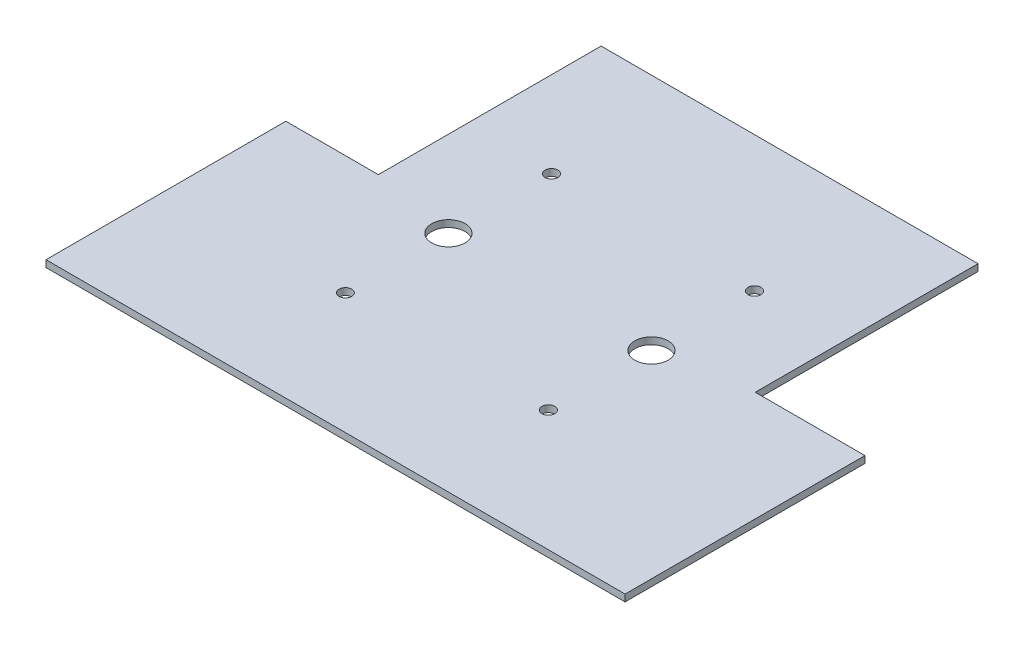
ISO-10303-21;
HEADER;
FILE_DESCRIPTION(('STEP AP214'),'2;1');
FILE_NAME('part.step','',(''),(''),'','','');
FILE_SCHEMA(('AUTOMOTIVE_DESIGN { 1 0 10303 214 1 1 1 1 }'));
ENDSEC;
DATA;
#1=APPLICATION_CONTEXT('core data for automotive mechanical design processes');
#2=APPLICATION_PROTOCOL_DEFINITION('international standard','automotive_design',2000,#1);
#3=PRODUCT_CONTEXT('',#1,'mechanical');
#4=PRODUCT('Part','Part','',(#3));
#5=PRODUCT_RELATED_PRODUCT_CATEGORY('part','',(#4));
#6=PRODUCT_DEFINITION_FORMATION('','',#4);
#7=PRODUCT_DEFINITION_CONTEXT('part definition',#1,'design');
#8=PRODUCT_DEFINITION('design','',#6,#7);
#9=PRODUCT_DEFINITION_SHAPE('','',#8);
#10=(LENGTH_UNIT() NAMED_UNIT(*) SI_UNIT(.MILLI.,.METRE.));
#11=(NAMED_UNIT(*) PLANE_ANGLE_UNIT() SI_UNIT($,.RADIAN.));
#12=(NAMED_UNIT(*) SI_UNIT($,.STERADIAN.) SOLID_ANGLE_UNIT());
#13=UNCERTAINTY_MEASURE_WITH_UNIT(LENGTH_MEASURE(1.E-05),#10,'distance_accuracy_value','');
#14=(GEOMETRIC_REPRESENTATION_CONTEXT(3) GLOBAL_UNCERTAINTY_ASSIGNED_CONTEXT((#13)) GLOBAL_UNIT_ASSIGNED_CONTEXT((#10,
#11,#12)) REPRESENTATION_CONTEXT('',''));
#15=CARTESIAN_POINT('',(0.,0.,0.));
#16=DIRECTION('',(0.,0.,1.));
#17=DIRECTION('',(1.,0.,0.));
#18=AXIS2_PLACEMENT_3D('',#15,#16,#17);
#19=CARTESIAN_POINT('',(0.,2.,0.));
#20=DIRECTION('',(0.,0.,1.));
#21=DIRECTION('',(1.,0.,0.));
#22=AXIS2_PLACEMENT_3D('',#19,#20,#21);
#23=PLANE('',#22);
#24=DIRECTION('',(-1.,0.,0.));
#25=VECTOR('',#24,1.);
#26=CARTESIAN_POINT('',(0.,0.,0.));
#27=LINE('',#26,#25);
#28=CARTESIAN_POINT('',(110.,0.,0.));
#29=VERTEX_POINT('',#28);
#30=CARTESIAN_POINT('',(0.,0.,0.));
#31=VERTEX_POINT('',#30);
#32=EDGE_CURVE('E139',#29,#31,#27,.T.);
#33=ORIENTED_EDGE('',*,*,#32,.T.);
#34=DIRECTION('',(0.,-1.,0.));
#35=VECTOR('',#34,1.);
#36=CARTESIAN_POINT('',(0.,2.,0.));
#37=LINE('',#36,#35);
#38=CARTESIAN_POINT('',(0.,2.,0.));
#39=VERTEX_POINT('',#38);
#40=EDGE_CURVE('E11',#39,#31,#37,.T.);
#41=ORIENTED_EDGE('',*,*,#40,.F.);
#42=DIRECTION('',(-1.,0.,0.));
#43=VECTOR('',#42,1.);
#44=CARTESIAN_POINT('',(0.,2.,0.));
#45=LINE('',#44,#43);
#46=CARTESIAN_POINT('',(110.,2.,0.));
#47=VERTEX_POINT('',#46);
#48=EDGE_CURVE('E157',#47,#39,#45,.T.);
#49=ORIENTED_EDGE('',*,*,#48,.F.);
#50=DIRECTION('',(0.,-1.,0.));
#51=VECTOR('',#50,1.);
#52=CARTESIAN_POINT('',(110.,2.,0.));
#53=LINE('',#52,#51);
#54=EDGE_CURVE('E135',#47,#29,#53,.T.);
#55=ORIENTED_EDGE('',*,*,#54,.T.);
#56=EDGE_LOOP('',(#33,#41,#49,#55));
#57=FACE_BOUND('',#56,.T.);
#58=ADVANCED_FACE('F39',(#57),#23,.F.);
#59=CARTESIAN_POINT('',(0.,2.,65.));
#60=DIRECTION('',(1.,0.,0.));
#61=DIRECTION('',(0.,0.,-1.));
#62=AXIS2_PLACEMENT_3D('',#59,#60,#61);
#63=PLANE('',#62);
#64=DIRECTION('',(0.,0.,1.));
#65=VECTOR('',#64,1.);
#66=CARTESIAN_POINT('',(0.,0.,65.));
#67=LINE('',#66,#65);
#68=CARTESIAN_POINT('',(0.,0.,65.));
#69=VERTEX_POINT('',#68);
#70=EDGE_CURVE('E143',#31,#69,#67,.T.);
#71=ORIENTED_EDGE('',*,*,#70,.T.);
#72=DIRECTION('',(0.,-1.,0.));
#73=VECTOR('',#72,1.);
#74=CARTESIAN_POINT('',(0.,2.,65.));
#75=LINE('',#74,#73);
#76=CARTESIAN_POINT('',(0.,2.,65.));
#77=VERTEX_POINT('',#76);
#78=EDGE_CURVE('E48',#77,#69,#75,.T.);
#79=ORIENTED_EDGE('',*,*,#78,.F.);
#80=DIRECTION('',(0.,0.,1.));
#81=VECTOR('',#80,1.);
#82=CARTESIAN_POINT('',(0.,2.,65.));
#83=LINE('',#82,#81);
#84=EDGE_CURVE('E101',#39,#77,#83,.T.);
#85=ORIENTED_EDGE('',*,*,#84,.F.);
#86=ORIENTED_EDGE('',*,*,#40,.T.);
#87=EDGE_LOOP('',(#71,#79,#85,#86));
#88=FACE_BOUND('',#87,.T.);
#89=ADVANCED_FACE('F272',(#88),#63,.F.);
#90=CARTESIAN_POINT('',(0.,2.,65.));
#91=DIRECTION('',(0.,0.,1.));
#92=DIRECTION('',(1.,0.,0.));
#93=AXIS2_PLACEMENT_3D('',#90,#91,#92);
#94=PLANE('',#93);
#95=DIRECTION('',(-1.,0.,0.));
#96=VECTOR('',#95,1.);
#97=CARTESIAN_POINT('',(0.,0.,65.));
#98=LINE('',#97,#96);
#99=CARTESIAN_POINT('',(-27.,0.,65.));
#100=VERTEX_POINT('',#99);
#101=EDGE_CURVE('E147',#69,#100,#98,.T.);
#102=ORIENTED_EDGE('',*,*,#101,.T.);
#103=DIRECTION('',(0.,-1.,0.));
#104=VECTOR('',#103,1.);
#105=CARTESIAN_POINT('',(-27.,2.,65.));
#106=LINE('',#105,#104);
#107=CARTESIAN_POINT('',(-27.,2.,65.));
#108=VERTEX_POINT('',#107);
#109=EDGE_CURVE('E164',#108,#100,#106,.T.);
#110=ORIENTED_EDGE('',*,*,#109,.F.);
#111=DIRECTION('',(-1.,0.,0.));
#112=VECTOR('',#111,1.);
#113=CARTESIAN_POINT('',(0.,2.,65.));
#114=LINE('',#113,#112);
#115=EDGE_CURVE('E172',#77,#108,#114,.T.);
#116=ORIENTED_EDGE('',*,*,#115,.F.);
#117=ORIENTED_EDGE('',*,*,#78,.T.);
#118=EDGE_LOOP('',(#102,#110,#116,#117));
#119=FACE_BOUND('',#118,.T.);
#120=ADVANCED_FACE('F170',(#119),#94,.F.);
#121=CARTESIAN_POINT('',(-27.,2.,65.));
#122=DIRECTION('',(1.,0.,0.));
#123=DIRECTION('',(0.,0.,-1.));
#124=AXIS2_PLACEMENT_3D('',#121,#122,#123);
#125=PLANE('',#124);
#126=DIRECTION('',(0.,0.,1.));
#127=VECTOR('',#126,1.);
#128=CARTESIAN_POINT('',(-27.,0.,65.));
#129=LINE('',#128,#127);
#130=CARTESIAN_POINT('',(-27.,0.,135.));
#131=VERTEX_POINT('',#130);
#132=EDGE_CURVE('E149',#100,#131,#129,.T.);
#133=ORIENTED_EDGE('',*,*,#132,.T.);
#134=DIRECTION('',(0.,-1.,0.));
#135=VECTOR('',#134,1.);
#136=CARTESIAN_POINT('',(-27.,2.,135.));
#137=LINE('',#136,#135);
#138=CARTESIAN_POINT('',(-27.,2.,135.));
#139=VERTEX_POINT('',#138);
#140=EDGE_CURVE('E161',#139,#131,#137,.T.);
#141=ORIENTED_EDGE('',*,*,#140,.F.);
#142=DIRECTION('',(0.,0.,1.));
#143=VECTOR('',#142,1.);
#144=CARTESIAN_POINT('',(-27.,2.,65.));
#145=LINE('',#144,#143);
#146=EDGE_CURVE('E184',#108,#139,#145,.T.);
#147=ORIENTED_EDGE('',*,*,#146,.F.);
#148=ORIENTED_EDGE('',*,*,#109,.T.);
#149=EDGE_LOOP('',(#133,#141,#147,#148));
#150=FACE_BOUND('',#149,.T.);
#151=ADVANCED_FACE('F180',(#150),#125,.F.);
#152=CARTESIAN_POINT('',(142.,2.,135.));
#153=DIRECTION('',(0.,0.,-1.));
#154=DIRECTION('',(-1.,0.,0.));
#155=AXIS2_PLACEMENT_3D('',#152,#153,#154);
#156=PLANE('',#155);
#157=DIRECTION('',(1.,0.,0.));
#158=VECTOR('',#157,1.);
#159=CARTESIAN_POINT('',(142.,0.,135.));
#160=LINE('',#159,#158);
#161=CARTESIAN_POINT('',(142.,0.,135.));
#162=VERTEX_POINT('',#161);
#163=EDGE_CURVE('E151',#131,#162,#160,.T.);
#164=ORIENTED_EDGE('',*,*,#163,.T.);
#165=DIRECTION('',(0.,-1.,0.));
#166=VECTOR('',#165,1.);
#167=CARTESIAN_POINT('',(142.,2.,135.));
#168=LINE('',#167,#166);
#169=CARTESIAN_POINT('',(142.,2.,135.));
#170=VERTEX_POINT('',#169);
#171=EDGE_CURVE('E129',#170,#162,#168,.T.);
#172=ORIENTED_EDGE('',*,*,#171,.F.);
#173=DIRECTION('',(1.,0.,0.));
#174=VECTOR('',#173,1.);
#175=CARTESIAN_POINT('',(142.,2.,135.));
#176=LINE('',#175,#174);
#177=EDGE_CURVE('E120',#139,#170,#176,.T.);
#178=ORIENTED_EDGE('',*,*,#177,.F.);
#179=ORIENTED_EDGE('',*,*,#140,.T.);
#180=EDGE_LOOP('',(#164,#172,#178,#179));
#181=FACE_BOUND('',#180,.T.);
#182=ADVANCED_FACE('F183',(#181),#156,.F.);
#183=CARTESIAN_POINT('',(142.,2.,65.));
#184=DIRECTION('',(-1.,0.,0.));
#185=DIRECTION('',(0.,0.,1.));
#186=AXIS2_PLACEMENT_3D('',#183,#184,#185);
#187=PLANE('',#186);
#188=DIRECTION('',(0.,0.,-1.));
#189=VECTOR('',#188,1.);
#190=CARTESIAN_POINT('',(142.,0.,65.));
#191=LINE('',#190,#189);
#192=CARTESIAN_POINT('',(142.,0.,65.));
#193=VERTEX_POINT('',#192);
#194=EDGE_CURVE('E128',#162,#193,#191,.T.);
#195=ORIENTED_EDGE('',*,*,#194,.T.);
#196=DIRECTION('',(0.,-1.,0.));
#197=VECTOR('',#196,1.);
#198=CARTESIAN_POINT('',(142.,2.,65.));
#199=LINE('',#198,#197);
#200=CARTESIAN_POINT('',(142.,2.,65.));
#201=VERTEX_POINT('',#200);
#202=EDGE_CURVE('E125',#201,#193,#199,.T.);
#203=ORIENTED_EDGE('',*,*,#202,.F.);
#204=DIRECTION('',(0.,0.,-1.));
#205=VECTOR('',#204,1.);
#206=CARTESIAN_POINT('',(142.,2.,65.));
#207=LINE('',#206,#205);
#208=EDGE_CURVE('E114',#170,#201,#207,.T.);
#209=ORIENTED_EDGE('',*,*,#208,.F.);
#210=ORIENTED_EDGE('',*,*,#171,.T.);
#211=EDGE_LOOP('',(#195,#203,#209,#210));
#212=FACE_BOUND('',#211,.T.);
#213=ADVANCED_FACE('F126',(#212),#187,.F.);
#214=CARTESIAN_POINT('',(142.,2.,65.));
#215=DIRECTION('',(0.,0.,1.));
#216=DIRECTION('',(1.,0.,0.));
#217=AXIS2_PLACEMENT_3D('',#214,#215,#216);
#218=PLANE('',#217);
#219=DIRECTION('',(-1.,0.,0.));
#220=VECTOR('',#219,1.);
#221=CARTESIAN_POINT('',(142.,0.,65.));
#222=LINE('',#221,#220);
#223=CARTESIAN_POINT('',(110.,0.,65.));
#224=VERTEX_POINT('',#223);
#225=EDGE_CURVE('E86',#193,#224,#222,.T.);
#226=ORIENTED_EDGE('',*,*,#225,.T.);
#227=DIRECTION('',(0.,-1.,0.));
#228=VECTOR('',#227,1.);
#229=CARTESIAN_POINT('',(110.,2.,65.));
#230=LINE('',#229,#228);
#231=CARTESIAN_POINT('',(110.,2.,65.));
#232=VERTEX_POINT('',#231);
#233=EDGE_CURVE('E130',#232,#224,#230,.T.);
#234=ORIENTED_EDGE('',*,*,#233,.F.);
#235=DIRECTION('',(-1.,0.,0.));
#236=VECTOR('',#235,1.);
#237=CARTESIAN_POINT('',(142.,2.,65.));
#238=LINE('',#237,#236);
#239=EDGE_CURVE('E118',#201,#232,#238,.T.);
#240=ORIENTED_EDGE('',*,*,#239,.F.);
#241=ORIENTED_EDGE('',*,*,#202,.T.);
#242=EDGE_LOOP('',(#226,#234,#240,#241));
#243=FACE_BOUND('',#242,.T.);
#244=ADVANCED_FACE('F132',(#243),#218,.F.);
#245=CARTESIAN_POINT('',(110.,2.,0.));
#246=DIRECTION('',(-1.,0.,0.));
#247=DIRECTION('',(0.,0.,1.));
#248=AXIS2_PLACEMENT_3D('',#245,#246,#247);
#249=PLANE('',#248);
#250=DIRECTION('',(0.,0.,-1.));
#251=VECTOR('',#250,1.);
#252=CARTESIAN_POINT('',(110.,0.,0.));
#253=LINE('',#252,#251);
#254=EDGE_CURVE('E92',#224,#29,#253,.T.);
#255=ORIENTED_EDGE('',*,*,#254,.T.);
#256=ORIENTED_EDGE('',*,*,#54,.F.);
#257=DIRECTION('',(0.,0.,-1.));
#258=VECTOR('',#257,1.);
#259=CARTESIAN_POINT('',(110.,2.,0.));
#260=LINE('',#259,#258);
#261=EDGE_CURVE('E56',#232,#47,#260,.T.);
#262=ORIENTED_EDGE('',*,*,#261,.F.);
#263=ORIENTED_EDGE('',*,*,#233,.T.);
#264=EDGE_LOOP('',(#255,#256,#262,#263));
#265=FACE_BOUND('',#264,.T.);
#266=ADVANCED_FACE('F245',(#265),#249,.F.);
#267=CARTESIAN_POINT('',(0.,2.,0.));
#268=DIRECTION('',(0.,-1.,0.));
#269=DIRECTION('',(0.,0.,-1.));
#270=AXIS2_PLACEMENT_3D('',#267,#268,#269);
#271=PLANE('',#270);
#272=CARTESIAN_POINT('',(25.0440836508669,2.,39.5229334980664));
#273=DIRECTION('',(0.,1.,0.));
#274=DIRECTION('',(0.,0.,1.));
#275=AXIS2_PLACEMENT_3D('',#272,#273,#274);
#276=CIRCLE('',#275,1.875);
#277=CARTESIAN_POINT('',(25.0440836508669,2.,41.3979334980664));
#278=VERTEX_POINT('',#277);
#279=EDGE_CURVE('E226',#278,#278,#276,.T.);
#280=ORIENTED_EDGE('',*,*,#279,.F.);
#281=EDGE_LOOP('',(#280));
#282=FACE_BOUND('',#281,.T.);
#283=CARTESIAN_POINT('',(84.294083650876,2.,39.5229334980664));
#284=DIRECTION('',(0.,1.,0.));
#285=DIRECTION('',(0.,0.,1.));
#286=AXIS2_PLACEMENT_3D('',#283,#284,#285);
#287=CIRCLE('',#286,1.875);
#288=CARTESIAN_POINT('',(84.294083650876,2.,41.3979334980664));
#289=VERTEX_POINT('',#288);
#290=EDGE_CURVE('E220',#289,#289,#287,.T.);
#291=ORIENTED_EDGE('',*,*,#290,.F.);
#292=EDGE_LOOP('',(#291));
#293=FACE_BOUND('',#292,.T.);
#294=CARTESIAN_POINT('',(25.0440836508761,2.,99.6729334980666));
#295=DIRECTION('',(0.,1.,0.));
#296=DIRECTION('',(0.,0.,1.));
#297=AXIS2_PLACEMENT_3D('',#294,#295,#296);
#298=CIRCLE('',#297,1.84530775872192);
#299=CARTESIAN_POINT('',(25.0440836508761,2.,101.518241256789));
#300=VERTEX_POINT('',#299);
#301=EDGE_CURVE('E212',#300,#300,#298,.T.);
#302=ORIENTED_EDGE('',*,*,#301,.F.);
#303=EDGE_LOOP('',(#302));
#304=FACE_BOUND('',#303,.T.);
#305=CARTESIAN_POINT('',(84.2940836508863,2.,99.6729334980648));
#306=DIRECTION('',(0.,1.,0.));
#307=DIRECTION('',(0.,0.,1.));
#308=AXIS2_PLACEMENT_3D('',#305,#306,#307);
#309=CIRCLE('',#308,1.87500000000002);
#310=CARTESIAN_POINT('',(84.2940836508863,2.,101.547933498065));
#311=VERTEX_POINT('',#310);
#312=EDGE_CURVE('E206',#311,#311,#309,.T.);
#313=ORIENTED_EDGE('',*,*,#312,.F.);
#314=EDGE_LOOP('',(#313));
#315=FACE_BOUND('',#314,.T.);
#316=CARTESIAN_POINT('',(84.294083650876,2.,69.5979334980664));
#317=DIRECTION('',(0.,1.,0.));
#318=DIRECTION('',(0.,0.,1.));
#319=AXIS2_PLACEMENT_3D('',#316,#317,#318);
#320=CIRCLE('',#319,4.875);
#321=CARTESIAN_POINT('',(84.294083650876,2.,74.4729334980664));
#322=VERTEX_POINT('',#321);
#323=EDGE_CURVE('E200',#322,#322,#320,.T.);
#324=ORIENTED_EDGE('',*,*,#323,.F.);
#325=EDGE_LOOP('',(#324));
#326=FACE_BOUND('',#325,.T.);
#327=CARTESIAN_POINT('',(25.0440836508761,2.,69.5979334980663));
#328=DIRECTION('',(0.,1.,0.));
#329=DIRECTION('',(0.,0.,1.));
#330=AXIS2_PLACEMENT_3D('',#327,#328,#329);
#331=CIRCLE('',#330,4.875);
#332=CARTESIAN_POINT('',(25.0440836508761,2.,74.4729334980663));
#333=VERTEX_POINT('',#332);
#334=EDGE_CURVE('E192',#333,#333,#331,.T.);
#335=ORIENTED_EDGE('',*,*,#334,.F.);
#336=EDGE_LOOP('',(#335));
#337=FACE_BOUND('',#336,.T.);
#338=ORIENTED_EDGE('',*,*,#48,.T.);
#339=ORIENTED_EDGE('',*,*,#84,.T.);
#340=ORIENTED_EDGE('',*,*,#115,.T.);
#341=ORIENTED_EDGE('',*,*,#146,.T.);
#342=ORIENTED_EDGE('',*,*,#177,.T.);
#343=ORIENTED_EDGE('',*,*,#208,.T.);
#344=ORIENTED_EDGE('',*,*,#239,.T.);
#345=ORIENTED_EDGE('',*,*,#261,.T.);
#346=EDGE_LOOP('',(#338,#339,#340,#341,#342,#343,#344,#345));
#347=FACE_BOUND('',#346,.T.);
#348=ADVANCED_FACE('F116',(#282,#293,#304,#315,#326,#337,#347),#271,.F.);
#349=CARTESIAN_POINT('',(0.,0.,0.));
#350=DIRECTION('',(0.,-1.,0.));
#351=DIRECTION('',(0.,0.,-1.));
#352=AXIS2_PLACEMENT_3D('',#349,#350,#351);
#353=PLANE('',#352);
#354=CARTESIAN_POINT('',(25.0440836508669,0.,39.5229334980664));
#355=DIRECTION('',(0.,1.,0.));
#356=DIRECTION('',(0.,0.,1.));
#357=AXIS2_PLACEMENT_3D('',#354,#355,#356);
#358=CIRCLE('',#357,1.875);
#359=CARTESIAN_POINT('',(25.0440836508669,0.,41.3979334980664));
#360=VERTEX_POINT('',#359);
#361=EDGE_CURVE('E223',#360,#360,#358,.T.);
#362=ORIENTED_EDGE('',*,*,#361,.T.);
#363=EDGE_LOOP('',(#362));
#364=FACE_BOUND('',#363,.T.);
#365=CARTESIAN_POINT('',(84.294083650876,0.,39.5229334980664));
#366=DIRECTION('',(0.,1.,0.));
#367=DIRECTION('',(0.,0.,1.));
#368=AXIS2_PLACEMENT_3D('',#365,#366,#367);
#369=CIRCLE('',#368,1.875);
#370=CARTESIAN_POINT('',(84.294083650876,0.,41.3979334980664));
#371=VERTEX_POINT('',#370);
#372=EDGE_CURVE('E216',#371,#371,#369,.T.);
#373=ORIENTED_EDGE('',*,*,#372,.T.);
#374=EDGE_LOOP('',(#373));
#375=FACE_BOUND('',#374,.T.);
#376=CARTESIAN_POINT('',(25.0440836508761,0.,99.6729334980666));
#377=DIRECTION('',(0.,1.,0.));
#378=DIRECTION('',(0.,0.,1.));
#379=AXIS2_PLACEMENT_3D('',#376,#377,#378);
#380=CIRCLE('',#379,1.84530775872192);
#381=CARTESIAN_POINT('',(25.0440836508761,0.,101.518241256789));
#382=VERTEX_POINT('',#381);
#383=EDGE_CURVE('E209',#382,#382,#380,.T.);
#384=ORIENTED_EDGE('',*,*,#383,.T.);
#385=EDGE_LOOP('',(#384));
#386=FACE_BOUND('',#385,.T.);
#387=CARTESIAN_POINT('',(84.2940836508863,0.,99.6729334980648));
#388=DIRECTION('',(0.,1.,0.));
#389=DIRECTION('',(0.,0.,1.));
#390=AXIS2_PLACEMENT_3D('',#387,#388,#389);
#391=CIRCLE('',#390,1.87500000000002);
#392=CARTESIAN_POINT('',(84.2940836508863,0.,101.547933498065));
#393=VERTEX_POINT('',#392);
#394=EDGE_CURVE('E203',#393,#393,#391,.T.);
#395=ORIENTED_EDGE('',*,*,#394,.T.);
#396=EDGE_LOOP('',(#395));
#397=FACE_BOUND('',#396,.T.);
#398=CARTESIAN_POINT('',(84.294083650876,0.,69.5979334980664));
#399=DIRECTION('',(0.,1.,0.));
#400=DIRECTION('',(0.,0.,1.));
#401=AXIS2_PLACEMENT_3D('',#398,#399,#400);
#402=CIRCLE('',#401,4.875);
#403=CARTESIAN_POINT('',(84.294083650876,0.,74.4729334980664));
#404=VERTEX_POINT('',#403);
#405=EDGE_CURVE('E196',#404,#404,#402,.T.);
#406=ORIENTED_EDGE('',*,*,#405,.T.);
#407=EDGE_LOOP('',(#406));
#408=FACE_BOUND('',#407,.T.);
#409=CARTESIAN_POINT('',(25.0440836508761,0.,69.5979334980663));
#410=DIRECTION('',(0.,1.,0.));
#411=DIRECTION('',(0.,0.,1.));
#412=AXIS2_PLACEMENT_3D('',#409,#410,#411);
#413=CIRCLE('',#412,4.875);
#414=CARTESIAN_POINT('',(25.0440836508761,0.,74.4729334980663));
#415=VERTEX_POINT('',#414);
#416=EDGE_CURVE('E144',#415,#415,#413,.T.);
#417=ORIENTED_EDGE('',*,*,#416,.T.);
#418=EDGE_LOOP('',(#417));
#419=FACE_BOUND('',#418,.T.);
#420=ORIENTED_EDGE('',*,*,#32,.F.);
#421=ORIENTED_EDGE('',*,*,#254,.F.);
#422=ORIENTED_EDGE('',*,*,#225,.F.);
#423=ORIENTED_EDGE('',*,*,#194,.F.);
#424=ORIENTED_EDGE('',*,*,#163,.F.);
#425=ORIENTED_EDGE('',*,*,#132,.F.);
#426=ORIENTED_EDGE('',*,*,#101,.F.);
#427=ORIENTED_EDGE('',*,*,#70,.F.);
#428=EDGE_LOOP('',(#420,#421,#422,#423,#424,#425,#426,#427));
#429=FACE_BOUND('',#428,.T.);
#430=ADVANCED_FACE('F176',(#364,#375,#386,#397,#408,#419,#429),#353,.T.);
#431=CARTESIAN_POINT('',(25.0440836508761,0.,69.5979334980663));
#432=DIRECTION('',(0.,1.,0.));
#433=DIRECTION('',(0.,0.,1.));
#434=AXIS2_PLACEMENT_3D('',#431,#432,#433);
#435=CYLINDRICAL_SURFACE('',#434,4.875);
#436=ORIENTED_EDGE('',*,*,#416,.F.);
#437=EDGE_LOOP('',(#436));
#438=FACE_BOUND('',#437,.T.);
#439=ORIENTED_EDGE('',*,*,#334,.T.);
#440=EDGE_LOOP('',(#439));
#441=FACE_BOUND('',#440,.T.);
#442=ADVANCED_FACE('F257',(#438,#441),#435,.F.);
#443=CARTESIAN_POINT('',(84.294083650876,0.,69.5979334980664));
#444=DIRECTION('',(0.,1.,0.));
#445=DIRECTION('',(0.,0.,1.));
#446=AXIS2_PLACEMENT_3D('',#443,#444,#445);
#447=CYLINDRICAL_SURFACE('',#446,4.875);
#448=ORIENTED_EDGE('',*,*,#405,.F.);
#449=EDGE_LOOP('',(#448));
#450=FACE_BOUND('',#449,.T.);
#451=ORIENTED_EDGE('',*,*,#323,.T.);
#452=EDGE_LOOP('',(#451));
#453=FACE_BOUND('',#452,.T.);
#454=ADVANCED_FACE('F259',(#450,#453),#447,.F.);
#455=CARTESIAN_POINT('',(84.2940836508863,0.,99.6729334980648));
#456=DIRECTION('',(0.,1.,0.));
#457=DIRECTION('',(0.,0.,1.));
#458=AXIS2_PLACEMENT_3D('',#455,#456,#457);
#459=CYLINDRICAL_SURFACE('',#458,1.87500000000002);
#460=ORIENTED_EDGE('',*,*,#394,.F.);
#461=EDGE_LOOP('',(#460));
#462=FACE_BOUND('',#461,.T.);
#463=ORIENTED_EDGE('',*,*,#312,.T.);
#464=EDGE_LOOP('',(#463));
#465=FACE_BOUND('',#464,.T.);
#466=ADVANCED_FACE('F266',(#462,#465),#459,.F.);
#467=CARTESIAN_POINT('',(25.0440836508761,0.,99.6729334980666));
#468=DIRECTION('',(0.,1.,0.));
#469=DIRECTION('',(0.,0.,1.));
#470=AXIS2_PLACEMENT_3D('',#467,#468,#469);
#471=CYLINDRICAL_SURFACE('',#470,1.84530775872192);
#472=ORIENTED_EDGE('',*,*,#383,.F.);
#473=EDGE_LOOP('',(#472));
#474=FACE_BOUND('',#473,.T.);
#475=ORIENTED_EDGE('',*,*,#301,.T.);
#476=EDGE_LOOP('',(#475));
#477=FACE_BOUND('',#476,.T.);
#478=ADVANCED_FACE('F338',(#474,#477),#471,.F.);
#479=CARTESIAN_POINT('',(84.294083650876,0.,39.5229334980664));
#480=DIRECTION('',(0.,1.,0.));
#481=DIRECTION('',(0.,0.,1.));
#482=AXIS2_PLACEMENT_3D('',#479,#480,#481);
#483=CYLINDRICAL_SURFACE('',#482,1.875);
#484=ORIENTED_EDGE('',*,*,#372,.F.);
#485=EDGE_LOOP('',(#484));
#486=FACE_BOUND('',#485,.T.);
#487=ORIENTED_EDGE('',*,*,#290,.T.);
#488=EDGE_LOOP('',(#487));
#489=FACE_BOUND('',#488,.T.);
#490=ADVANCED_FACE('F239',(#486,#489),#483,.F.);
#491=CARTESIAN_POINT('',(25.0440836508669,0.,39.5229334980664));
#492=DIRECTION('',(0.,1.,0.));
#493=DIRECTION('',(0.,0.,1.));
#494=AXIS2_PLACEMENT_3D('',#491,#492,#493);
#495=CYLINDRICAL_SURFACE('',#494,1.875);
#496=ORIENTED_EDGE('',*,*,#361,.F.);
#497=EDGE_LOOP('',(#496));
#498=FACE_BOUND('',#497,.T.);
#499=ORIENTED_EDGE('',*,*,#279,.T.);
#500=EDGE_LOOP('',(#499));
#501=FACE_BOUND('',#500,.T.);
#502=ADVANCED_FACE('F236',(#498,#501),#495,.F.);
#503=CLOSED_SHELL('',(#58,#89,#120,#151,#182,#213,#244,#266,#348,#430,#442,#454,#466,#478,#490,#502));
#504=MANIFOLD_SOLID_BREP('B2',#503);
#505=ADVANCED_BREP_SHAPE_REPRESENTATION('',(#18,#504),#14);
#506=SHAPE_DEFINITION_REPRESENTATION(#9,#505);
ENDSEC;
END-ISO-10303-21;
